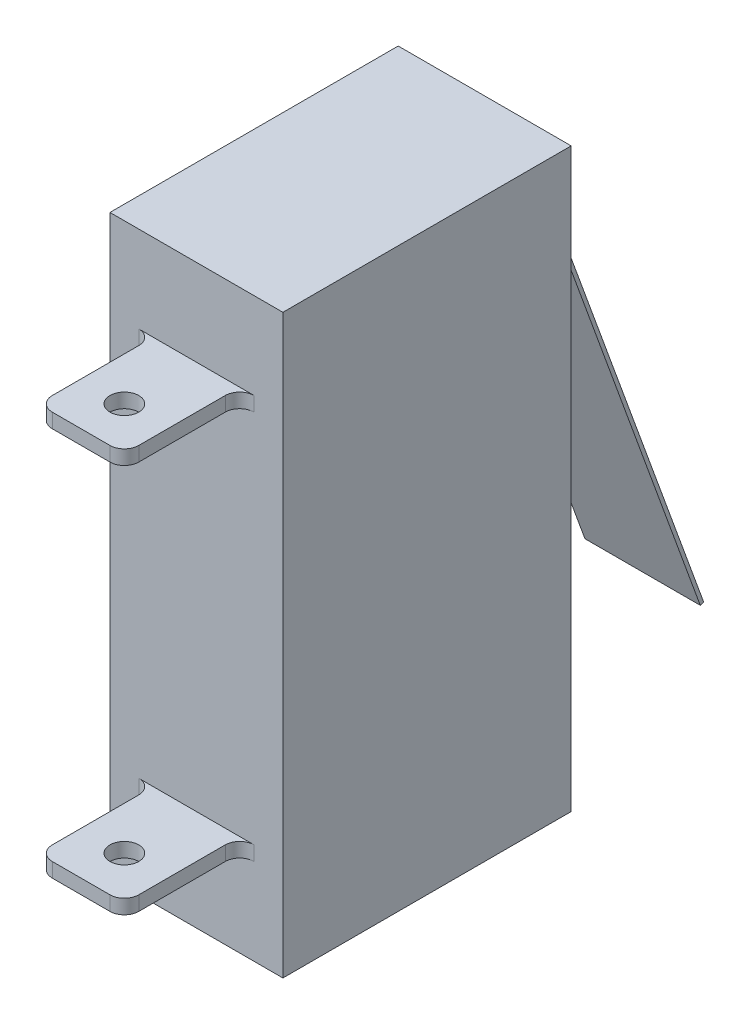
ISO-10303-21;
HEADER;
FILE_DESCRIPTION(('STEP AP214'),'2;1');
FILE_NAME('part.step','',(''),(''),'','','');
FILE_SCHEMA(('AUTOMOTIVE_DESIGN { 1 0 10303 214 1 1 1 1 }'));
ENDSEC;
DATA;
#1=APPLICATION_CONTEXT('core data for automotive mechanical design processes');
#2=APPLICATION_PROTOCOL_DEFINITION('international standard','automotive_design',2000,#1);
#3=PRODUCT_CONTEXT('',#1,'mechanical');
#4=PRODUCT('Part','Part','',(#3));
#5=PRODUCT_RELATED_PRODUCT_CATEGORY('part','',(#4));
#6=PRODUCT_DEFINITION_FORMATION('','',#4);
#7=PRODUCT_DEFINITION_CONTEXT('part definition',#1,'design');
#8=PRODUCT_DEFINITION('design','',#6,#7);
#9=PRODUCT_DEFINITION_SHAPE('','',#8);
#10=(LENGTH_UNIT() NAMED_UNIT(*) SI_UNIT(.MILLI.,.METRE.));
#11=(NAMED_UNIT(*) PLANE_ANGLE_UNIT() SI_UNIT($,.RADIAN.));
#12=(NAMED_UNIT(*) SI_UNIT($,.STERADIAN.) SOLID_ANGLE_UNIT());
#13=UNCERTAINTY_MEASURE_WITH_UNIT(LENGTH_MEASURE(1.E-05),#10,'distance_accuracy_value','');
#14=(GEOMETRIC_REPRESENTATION_CONTEXT(3) GLOBAL_UNCERTAINTY_ASSIGNED_CONTEXT((#13)) GLOBAL_UNIT_ASSIGNED_CONTEXT((#10,
#11,#12)) REPRESENTATION_CONTEXT('',''));
#15=CARTESIAN_POINT('',(0.,0.,0.));
#16=DIRECTION('',(0.,0.,1.));
#17=DIRECTION('',(1.,0.,0.));
#18=AXIS2_PLACEMENT_3D('',#15,#16,#17);
#19=CARTESIAN_POINT('',(6.,10.,-5.));
#20=DIRECTION('',(0.,0.,1.));
#21=DIRECTION('',(0.,-1.,0.));
#22=AXIS2_PLACEMENT_3D('',#19,#20,#21);
#23=PLANE('',#22);
#24=DIRECTION('',(0.,-1.,0.));
#25=VECTOR('',#24,1.);
#26=CARTESIAN_POINT('',(0.875,10.,-5.));
#27=LINE('',#26,#25);
#28=CARTESIAN_POINT('',(0.875,7.125,-5.));
#29=VERTEX_POINT('',#28);
#30=CARTESIAN_POINT('',(0.875,6.74473303781556,-5.));
#31=VERTEX_POINT('',#30);
#32=EDGE_CURVE('E458',#29,#31,#27,.T.);
#33=ORIENTED_EDGE('',*,*,#32,.T.);
#34=DIRECTION('',(-1.,0.,0.));
#35=VECTOR('',#34,1.);
#36=CARTESIAN_POINT('',(5.,6.74473303781556,-5.));
#37=LINE('',#36,#35);
#38=CARTESIAN_POINT('',(5.125,6.74473303781556,-5.));
#39=VERTEX_POINT('',#38);
#40=EDGE_CURVE('E461',#31,#39,#37,.F.);
#41=ORIENTED_EDGE('',*,*,#40,.T.);
#42=DIRECTION('',(0.,-1.,0.));
#43=VECTOR('',#42,1.);
#44=CARTESIAN_POINT('',(5.125,7.,-5.));
#45=LINE('',#44,#43);
#46=CARTESIAN_POINT('',(5.125,7.125,-5.));
#47=VERTEX_POINT('',#46);
#48=EDGE_CURVE('E456',#39,#47,#45,.F.);
#49=ORIENTED_EDGE('',*,*,#48,.T.);
#50=DIRECTION('',(1.,0.,0.));
#51=VECTOR('',#50,1.);
#52=CARTESIAN_POINT('',(1.,7.125,-5.));
#53=LINE('',#52,#51);
#54=EDGE_CURVE('E454',#47,#29,#53,.F.);
#55=ORIENTED_EDGE('',*,*,#54,.T.);
#56=EDGE_LOOP('',(#33,#41,#49,#55));
#57=FACE_BOUND('',#56,.T.);
#58=DIRECTION('',(0.,1.,0.));
#59=VECTOR('',#58,1.);
#60=CARTESIAN_POINT('',(0.,10.,-5.));
#61=LINE('',#60,#59);
#62=CARTESIAN_POINT('',(0.,-10.,-5.));
#63=VERTEX_POINT('',#62);
#64=CARTESIAN_POINT('',(0.,10.,-5.));
#65=VERTEX_POINT('',#64);
#66=EDGE_CURVE('E327',#63,#65,#61,.T.);
#67=ORIENTED_EDGE('',*,*,#66,.T.);
#68=DIRECTION('',(-1.,0.,0.));
#69=VECTOR('',#68,1.);
#70=CARTESIAN_POINT('',(6.,10.,-5.));
#71=LINE('',#70,#69);
#72=CARTESIAN_POINT('',(6.,10.,-5.));
#73=VERTEX_POINT('',#72);
#74=EDGE_CURVE('E354',#73,#65,#71,.T.);
#75=ORIENTED_EDGE('',*,*,#74,.F.);
#76=DIRECTION('',(0.,1.,0.));
#77=VECTOR('',#76,1.);
#78=CARTESIAN_POINT('',(6.,10.,-5.));
#79=LINE('',#78,#77);
#80=CARTESIAN_POINT('',(6.,-10.,-5.));
#81=VERTEX_POINT('',#80);
#82=EDGE_CURVE('E328',#81,#73,#79,.T.);
#83=ORIENTED_EDGE('',*,*,#82,.F.);
#84=DIRECTION('',(-1.,0.,0.));
#85=VECTOR('',#84,1.);
#86=CARTESIAN_POINT('',(6.,-10.,-5.));
#87=LINE('',#86,#85);
#88=EDGE_CURVE('E338',#81,#63,#87,.T.);
#89=ORIENTED_EDGE('',*,*,#88,.T.);
#90=EDGE_LOOP('',(#67,#75,#83,#89));
#91=FACE_BOUND('',#90,.T.);
#92=ADVANCED_FACE('F35',(#57,#91),#23,.F.);
#93=CARTESIAN_POINT('',(6.,10.,5.));
#94=DIRECTION('',(0.,0.,-1.));
#95=DIRECTION('',(0.,1.,0.));
#96=AXIS2_PLACEMENT_3D('',#93,#94,#95);
#97=PLANE('',#96);
#98=DIRECTION('',(1.,0.,0.));
#99=VECTOR('',#98,1.);
#100=CARTESIAN_POINT('',(1.5,6.5,5.));
#101=LINE('',#100,#99);
#102=CARTESIAN_POINT('',(1.,6.5,5.));
#103=VERTEX_POINT('',#102);
#104=CARTESIAN_POINT('',(5.,6.5,5.));
#105=VERTEX_POINT('',#104);
#106=EDGE_CURVE('E305',#103,#105,#101,.T.);
#107=ORIENTED_EDGE('',*,*,#106,.F.);
#108=DIRECTION('',(0.,-1.,0.));
#109=VECTOR('',#108,1.);
#110=CARTESIAN_POINT('',(1.,7.,5.));
#111=LINE('',#110,#109);
#112=CARTESIAN_POINT('',(1.,7.,5.));
#113=VERTEX_POINT('',#112);
#114=EDGE_CURVE('E365',#103,#113,#111,.F.);
#115=ORIENTED_EDGE('',*,*,#114,.T.);
#116=DIRECTION('',(-1.,0.,0.));
#117=VECTOR('',#116,1.);
#118=CARTESIAN_POINT('',(1.5,7.,5.));
#119=LINE('',#118,#117);
#120=CARTESIAN_POINT('',(5.,7.,5.));
#121=VERTEX_POINT('',#120);
#122=EDGE_CURVE('E310',#121,#113,#119,.T.);
#123=ORIENTED_EDGE('',*,*,#122,.F.);
#124=DIRECTION('',(0.,1.,0.));
#125=VECTOR('',#124,1.);
#126=CARTESIAN_POINT('',(5.,6.5,5.));
#127=LINE('',#126,#125);
#128=EDGE_CURVE('E362',#121,#105,#127,.F.);
#129=ORIENTED_EDGE('',*,*,#128,.T.);
#130=EDGE_LOOP('',(#107,#115,#123,#129));
#131=FACE_BOUND('',#130,.T.);
#132=DIRECTION('',(0.,-1.,0.));
#133=VECTOR('',#132,1.);
#134=CARTESIAN_POINT('',(0.,10.,5.));
#135=LINE('',#134,#133);
#136=CARTESIAN_POINT('',(0.,10.,5.));
#137=VERTEX_POINT('',#136);
#138=CARTESIAN_POINT('',(0.,-10.,5.));
#139=VERTEX_POINT('',#138);
#140=EDGE_CURVE('E343',#137,#139,#135,.T.);
#141=ORIENTED_EDGE('',*,*,#140,.T.);
#142=DIRECTION('',(-1.,0.,0.));
#143=VECTOR('',#142,1.);
#144=CARTESIAN_POINT('',(6.,-10.,5.));
#145=LINE('',#144,#143);
#146=CARTESIAN_POINT('',(6.,-10.,5.));
#147=VERTEX_POINT('',#146);
#148=EDGE_CURVE('E348',#147,#139,#145,.T.);
#149=ORIENTED_EDGE('',*,*,#148,.F.);
#150=DIRECTION('',(0.,-1.,0.));
#151=VECTOR('',#150,1.);
#152=CARTESIAN_POINT('',(6.,10.,5.));
#153=LINE('',#152,#151);
#154=CARTESIAN_POINT('',(6.,10.,5.));
#155=VERTEX_POINT('',#154);
#156=EDGE_CURVE('E334',#155,#147,#153,.T.);
#157=ORIENTED_EDGE('',*,*,#156,.F.);
#158=DIRECTION('',(-1.,0.,0.));
#159=VECTOR('',#158,1.);
#160=CARTESIAN_POINT('',(6.,10.,5.));
#161=LINE('',#160,#159);
#162=EDGE_CURVE('E351',#155,#137,#161,.T.);
#163=ORIENTED_EDGE('',*,*,#162,.T.);
#164=EDGE_LOOP('',(#141,#149,#157,#163));
#165=FACE_BOUND('',#164,.T.);
#166=DIRECTION('',(-1.,0.,0.));
#167=VECTOR('',#166,1.);
#168=CARTESIAN_POINT('',(1.5,-6.5,5.));
#169=LINE('',#168,#167);
#170=CARTESIAN_POINT('',(5.,-6.5,5.));
#171=VERTEX_POINT('',#170);
#172=CARTESIAN_POINT('',(1.,-6.5,5.));
#173=VERTEX_POINT('',#172);
#174=EDGE_CURVE('E288',#171,#173,#169,.T.);
#175=ORIENTED_EDGE('',*,*,#174,.F.);
#176=DIRECTION('',(0.,1.,0.));
#177=VECTOR('',#176,1.);
#178=CARTESIAN_POINT('',(5.,-7.,5.));
#179=LINE('',#178,#177);
#180=CARTESIAN_POINT('',(5.,-7.,5.));
#181=VERTEX_POINT('',#180);
#182=EDGE_CURVE('E371',#171,#181,#179,.F.);
#183=ORIENTED_EDGE('',*,*,#182,.T.);
#184=DIRECTION('',(1.,0.,0.));
#185=VECTOR('',#184,1.);
#186=CARTESIAN_POINT('',(1.5,-7.,5.));
#187=LINE('',#186,#185);
#188=CARTESIAN_POINT('',(1.,-7.,5.));
#189=VERTEX_POINT('',#188);
#190=EDGE_CURVE('E283',#189,#181,#187,.T.);
#191=ORIENTED_EDGE('',*,*,#190,.F.);
#192=DIRECTION('',(0.,-1.,0.));
#193=VECTOR('',#192,1.);
#194=CARTESIAN_POINT('',(1.,-6.5,5.));
#195=LINE('',#194,#193);
#196=EDGE_CURVE('E368',#189,#173,#195,.F.);
#197=ORIENTED_EDGE('',*,*,#196,.T.);
#198=EDGE_LOOP('',(#175,#183,#191,#197));
#199=FACE_BOUND('',#198,.T.);
#200=ADVANCED_FACE('F512',(#131,#165,#199),#97,.F.);
#201=CARTESIAN_POINT('',(6.,10.,5.));
#202=DIRECTION('',(0.,-1.,0.));
#203=DIRECTION('',(0.,0.,-1.));
#204=AXIS2_PLACEMENT_3D('',#201,#202,#203);
#205=PLANE('',#204);
#206=DIRECTION('',(0.,0.,1.));
#207=VECTOR('',#206,1.);
#208=CARTESIAN_POINT('',(0.,10.,5.));
#209=LINE('',#208,#207);
#210=EDGE_CURVE('E341',#65,#137,#209,.T.);
#211=ORIENTED_EDGE('',*,*,#210,.T.);
#212=ORIENTED_EDGE('',*,*,#162,.F.);
#213=DIRECTION('',(0.,0.,1.));
#214=VECTOR('',#213,1.);
#215=CARTESIAN_POINT('',(6.,10.,5.));
#216=LINE('',#215,#214);
#217=EDGE_CURVE('E331',#73,#155,#216,.T.);
#218=ORIENTED_EDGE('',*,*,#217,.F.);
#219=ORIENTED_EDGE('',*,*,#74,.T.);
#220=EDGE_LOOP('',(#211,#212,#218,#219));
#221=FACE_BOUND('',#220,.T.);
#222=ADVANCED_FACE('F524',(#221),#205,.F.);
#223=CARTESIAN_POINT('',(6.,-10.,5.));
#224=DIRECTION('',(0.,1.,0.));
#225=DIRECTION('',(0.,0.,1.));
#226=AXIS2_PLACEMENT_3D('',#223,#224,#225);
#227=PLANE('',#226);
#228=DIRECTION('',(0.,0.,-1.));
#229=VECTOR('',#228,1.);
#230=CARTESIAN_POINT('',(0.,-10.,5.));
#231=LINE('',#230,#229);
#232=EDGE_CURVE('E332',#139,#63,#231,.T.);
#233=ORIENTED_EDGE('',*,*,#232,.T.);
#234=ORIENTED_EDGE('',*,*,#88,.F.);
#235=DIRECTION('',(0.,0.,-1.));
#236=VECTOR('',#235,1.);
#237=CARTESIAN_POINT('',(6.,-10.,5.));
#238=LINE('',#237,#236);
#239=EDGE_CURVE('E336',#147,#81,#238,.T.);
#240=ORIENTED_EDGE('',*,*,#239,.F.);
#241=ORIENTED_EDGE('',*,*,#148,.T.);
#242=EDGE_LOOP('',(#233,#234,#240,#241));
#243=FACE_BOUND('',#242,.T.);
#244=ADVANCED_FACE('F531',(#243),#227,.F.);
#245=CARTESIAN_POINT('',(6.,0.,0.));
#246=DIRECTION('',(1.,0.,0.));
#247=DIRECTION('',(0.,0.,-1.));
#248=AXIS2_PLACEMENT_3D('',#245,#246,#247);
#249=PLANE('',#248);
#250=ORIENTED_EDGE('',*,*,#82,.T.);
#251=ORIENTED_EDGE('',*,*,#217,.T.);
#252=ORIENTED_EDGE('',*,*,#156,.T.);
#253=ORIENTED_EDGE('',*,*,#239,.T.);
#254=EDGE_LOOP('',(#250,#251,#252,#253));
#255=FACE_BOUND('',#254,.T.);
#256=ADVANCED_FACE('F527',(#255),#249,.T.);
#257=CARTESIAN_POINT('',(0.,0.,0.));
#258=DIRECTION('',(1.,0.,0.));
#259=DIRECTION('',(0.,0.,-1.));
#260=AXIS2_PLACEMENT_3D('',#257,#258,#259);
#261=PLANE('',#260);
#262=ORIENTED_EDGE('',*,*,#66,.F.);
#263=ORIENTED_EDGE('',*,*,#232,.F.);
#264=ORIENTED_EDGE('',*,*,#140,.F.);
#265=ORIENTED_EDGE('',*,*,#210,.F.);
#266=EDGE_LOOP('',(#262,#263,#264,#265));
#267=FACE_BOUND('',#266,.T.);
#268=ADVANCED_FACE('F520',(#267),#261,.F.);
#269=CARTESIAN_POINT('',(1.5,7.,9.));
#270=DIRECTION('',(1.,0.,0.));
#271=DIRECTION('',(0.,0.,-1.));
#272=AXIS2_PLACEMENT_3D('',#269,#270,#271);
#273=PLANE('',#272);
#274=DIRECTION('',(0.,0.,-1.));
#275=VECTOR('',#274,1.);
#276=CARTESIAN_POINT('',(1.5,7.,9.));
#277=LINE('',#276,#275);
#278=CARTESIAN_POINT('',(1.5,7.,8.5));
#279=VERTEX_POINT('',#278);
#280=CARTESIAN_POINT('',(1.5,7.,5.5));
#281=VERTEX_POINT('',#280);
#282=EDGE_CURVE('E313',#279,#281,#277,.T.);
#283=ORIENTED_EDGE('',*,*,#282,.T.);
#284=DIRECTION('',(0.,-1.,0.));
#285=VECTOR('',#284,1.);
#286=CARTESIAN_POINT('',(1.5,6.5,5.5));
#287=LINE('',#286,#285);
#288=CARTESIAN_POINT('',(1.5,6.5,5.5));
#289=VERTEX_POINT('',#288);
#290=EDGE_CURVE('E395',#281,#289,#287,.T.);
#291=ORIENTED_EDGE('',*,*,#290,.T.);
#292=DIRECTION('',(0.,0.,-1.));
#293=VECTOR('',#292,1.);
#294=CARTESIAN_POINT('',(1.5,6.5,9.));
#295=LINE('',#294,#293);
#296=CARTESIAN_POINT('',(1.5,6.5,8.5));
#297=VERTEX_POINT('',#296);
#298=EDGE_CURVE('E324',#297,#289,#295,.T.);
#299=ORIENTED_EDGE('',*,*,#298,.F.);
#300=DIRECTION('',(0.,-1.,0.));
#301=VECTOR('',#300,1.);
#302=CARTESIAN_POINT('',(1.5,7.,8.5));
#303=LINE('',#302,#301);
#304=EDGE_CURVE('E393',#297,#279,#303,.F.);
#305=ORIENTED_EDGE('',*,*,#304,.T.);
#306=EDGE_LOOP('',(#283,#291,#299,#305));
#307=FACE_BOUND('',#306,.T.);
#308=ADVANCED_FACE('F826',(#307),#273,.F.);
#309=CARTESIAN_POINT('',(1.5,6.5,9.));
#310=DIRECTION('',(0.,1.,0.));
#311=DIRECTION('',(0.,0.,1.));
#312=AXIS2_PLACEMENT_3D('',#309,#310,#311);
#313=PLANE('',#312);
#314=CARTESIAN_POINT('',(3.,6.5,7.5));
#315=DIRECTION('',(0.,1.,0.));
#316=DIRECTION('',(0.,0.,1.));
#317=AXIS2_PLACEMENT_3D('',#314,#315,#316);
#318=CIRCLE('',#317,0.5);
#319=CARTESIAN_POINT('',(3.,6.5,8.));
#320=VERTEX_POINT('',#319);
#321=EDGE_CURVE('E280',#320,#320,#318,.T.);
#322=ORIENTED_EDGE('',*,*,#321,.T.);
#323=EDGE_LOOP('',(#322));
#324=FACE_BOUND('',#323,.T.);
#325=DIRECTION('',(1.,0.,0.));
#326=VECTOR('',#325,1.);
#327=CARTESIAN_POINT('',(1.5,6.5,9.));
#328=LINE('',#327,#326);
#329=CARTESIAN_POINT('',(2.,6.5,9.));
#330=VERTEX_POINT('',#329);
#331=CARTESIAN_POINT('',(4.,6.5,9.));
#332=VERTEX_POINT('',#331);
#333=EDGE_CURVE('E306',#330,#332,#328,.T.);
#334=ORIENTED_EDGE('',*,*,#333,.F.);
#335=CARTESIAN_POINT('',(2.,6.5,8.5));
#336=DIRECTION('',(0.,1.,0.));
#337=DIRECTION('',(0.,0.,1.));
#338=AXIS2_PLACEMENT_3D('',#335,#336,#337);
#339=CIRCLE('',#338,0.5);
#340=EDGE_CURVE('E411',#330,#297,#339,.F.);
#341=ORIENTED_EDGE('',*,*,#340,.T.);
#342=ORIENTED_EDGE('',*,*,#298,.T.);
#343=CARTESIAN_POINT('',(1.,6.5,5.5));
#344=DIRECTION('',(0.,1.,0.));
#345=DIRECTION('',(0.,0.,1.));
#346=AXIS2_PLACEMENT_3D('',#343,#344,#345);
#347=CIRCLE('',#346,0.5);
#348=EDGE_CURVE('E427',#289,#103,#347,.T.);
#349=ORIENTED_EDGE('',*,*,#348,.T.);
#350=ORIENTED_EDGE('',*,*,#106,.T.);
#351=CARTESIAN_POINT('',(5.,6.5,5.5));
#352=DIRECTION('',(0.,1.,0.));
#353=DIRECTION('',(0.,0.,1.));
#354=AXIS2_PLACEMENT_3D('',#351,#352,#353);
#355=CIRCLE('',#354,0.5);
#356=CARTESIAN_POINT('',(4.5,6.5,5.5));
#357=VERTEX_POINT('',#356);
#358=EDGE_CURVE('E435',#105,#357,#355,.T.);
#359=ORIENTED_EDGE('',*,*,#358,.T.);
#360=DIRECTION('',(0.,0.,-1.));
#361=VECTOR('',#360,1.);
#362=CARTESIAN_POINT('',(4.5,6.5,9.));
#363=LINE('',#362,#361);
#364=CARTESIAN_POINT('',(4.5,6.5,8.5));
#365=VERTEX_POINT('',#364);
#366=EDGE_CURVE('E321',#365,#357,#363,.T.);
#367=ORIENTED_EDGE('',*,*,#366,.F.);
#368=CARTESIAN_POINT('',(4.,6.5,8.5));
#369=DIRECTION('',(0.,1.,0.));
#370=DIRECTION('',(0.,0.,1.));
#371=AXIS2_PLACEMENT_3D('',#368,#369,#370);
#372=CIRCLE('',#371,0.5);
#373=EDGE_CURVE('E409',#365,#332,#372,.F.);
#374=ORIENTED_EDGE('',*,*,#373,.T.);
#375=EDGE_LOOP('',(#334,#341,#342,#349,#350,#359,#367,#374));
#376=FACE_BOUND('',#375,.T.);
#377=ADVANCED_FACE('F832',(#324,#376),#313,.F.);
#378=CARTESIAN_POINT('',(4.5,7.,9.));
#379=DIRECTION('',(-1.,0.,0.));
#380=DIRECTION('',(0.,0.,1.));
#381=AXIS2_PLACEMENT_3D('',#378,#379,#380);
#382=PLANE('',#381);
#383=ORIENTED_EDGE('',*,*,#366,.T.);
#384=DIRECTION('',(0.,1.,0.));
#385=VECTOR('',#384,1.);
#386=CARTESIAN_POINT('',(4.5,7.,5.5));
#387=LINE('',#386,#385);
#388=CARTESIAN_POINT('',(4.5,7.,5.5));
#389=VERTEX_POINT('',#388);
#390=EDGE_CURVE('E400',#357,#389,#387,.T.);
#391=ORIENTED_EDGE('',*,*,#390,.T.);
#392=DIRECTION('',(0.,0.,-1.));
#393=VECTOR('',#392,1.);
#394=CARTESIAN_POINT('',(4.5,7.,9.));
#395=LINE('',#394,#393);
#396=CARTESIAN_POINT('',(4.5,7.,8.5));
#397=VERTEX_POINT('',#396);
#398=EDGE_CURVE('E318',#397,#389,#395,.T.);
#399=ORIENTED_EDGE('',*,*,#398,.F.);
#400=DIRECTION('',(0.,1.,0.));
#401=VECTOR('',#400,1.);
#402=CARTESIAN_POINT('',(4.5,6.5,8.5));
#403=LINE('',#402,#401);
#404=EDGE_CURVE('E398',#397,#365,#403,.F.);
#405=ORIENTED_EDGE('',*,*,#404,.T.);
#406=EDGE_LOOP('',(#383,#391,#399,#405));
#407=FACE_BOUND('',#406,.T.);
#408=ADVANCED_FACE('F839',(#407),#382,.F.);
#409=CARTESIAN_POINT('',(1.5,7.,9.));
#410=DIRECTION('',(0.,-1.,0.));
#411=DIRECTION('',(0.,0.,-1.));
#412=AXIS2_PLACEMENT_3D('',#409,#410,#411);
#413=PLANE('',#412);
#414=CARTESIAN_POINT('',(3.,7.,7.5));
#415=DIRECTION('',(0.,-1.,0.));
#416=DIRECTION('',(0.,0.,-1.));
#417=AXIS2_PLACEMENT_3D('',#414,#415,#416);
#418=CIRCLE('',#417,0.5);
#419=CARTESIAN_POINT('',(3.,7.,7.));
#420=VERTEX_POINT('',#419);
#421=EDGE_CURVE('E277',#420,#420,#418,.T.);
#422=ORIENTED_EDGE('',*,*,#421,.T.);
#423=EDGE_LOOP('',(#422));
#424=FACE_BOUND('',#423,.T.);
#425=ORIENTED_EDGE('',*,*,#282,.F.);
#426=CARTESIAN_POINT('',(2.,7.,8.5));
#427=DIRECTION('',(0.,-1.,0.));
#428=DIRECTION('',(0.,0.,-1.));
#429=AXIS2_PLACEMENT_3D('',#426,#427,#428);
#430=CIRCLE('',#429,0.5);
#431=CARTESIAN_POINT('',(2.,7.,9.));
#432=VERTEX_POINT('',#431);
#433=EDGE_CURVE('E415',#279,#432,#430,.F.);
#434=ORIENTED_EDGE('',*,*,#433,.T.);
#435=DIRECTION('',(-1.,0.,0.));
#436=VECTOR('',#435,1.);
#437=CARTESIAN_POINT('',(1.5,7.,9.));
#438=LINE('',#437,#436);
#439=CARTESIAN_POINT('',(4.,7.,9.));
#440=VERTEX_POINT('',#439);
#441=EDGE_CURVE('E309',#440,#432,#438,.T.);
#442=ORIENTED_EDGE('',*,*,#441,.F.);
#443=CARTESIAN_POINT('',(4.,7.,8.5));
#444=DIRECTION('',(0.,-1.,0.));
#445=DIRECTION('',(0.,0.,-1.));
#446=AXIS2_PLACEMENT_3D('',#443,#444,#445);
#447=CIRCLE('',#446,0.5);
#448=EDGE_CURVE('E413',#440,#397,#447,.F.);
#449=ORIENTED_EDGE('',*,*,#448,.T.);
#450=ORIENTED_EDGE('',*,*,#398,.T.);
#451=CARTESIAN_POINT('',(5.,7.,5.5));
#452=DIRECTION('',(0.,-1.,0.));
#453=DIRECTION('',(0.,0.,-1.));
#454=AXIS2_PLACEMENT_3D('',#451,#452,#453);
#455=CIRCLE('',#454,0.5);
#456=EDGE_CURVE('E432',#389,#121,#455,.T.);
#457=ORIENTED_EDGE('',*,*,#456,.T.);
#458=ORIENTED_EDGE('',*,*,#122,.T.);
#459=CARTESIAN_POINT('',(1.,7.,5.5));
#460=DIRECTION('',(0.,-1.,0.));
#461=DIRECTION('',(0.,0.,-1.));
#462=AXIS2_PLACEMENT_3D('',#459,#460,#461);
#463=CIRCLE('',#462,0.5);
#464=EDGE_CURVE('E430',#113,#281,#463,.T.);
#465=ORIENTED_EDGE('',*,*,#464,.T.);
#466=EDGE_LOOP('',(#425,#434,#442,#449,#450,#457,#458,#465));
#467=FACE_BOUND('',#466,.T.);
#468=ADVANCED_FACE('F846',(#424,#467),#413,.F.);
#469=CARTESIAN_POINT('',(0.,0.,9.));
#470=DIRECTION('',(0.,0.,1.));
#471=DIRECTION('',(1.,0.,0.));
#472=AXIS2_PLACEMENT_3D('',#469,#470,#471);
#473=PLANE('',#472);
#474=ORIENTED_EDGE('',*,*,#441,.T.);
#475=DIRECTION('',(0.,-1.,0.));
#476=VECTOR('',#475,1.);
#477=CARTESIAN_POINT('',(2.,6.5,9.));
#478=LINE('',#477,#476);
#479=EDGE_CURVE('E406',#432,#330,#478,.T.);
#480=ORIENTED_EDGE('',*,*,#479,.T.);
#481=ORIENTED_EDGE('',*,*,#333,.T.);
#482=DIRECTION('',(0.,1.,0.));
#483=VECTOR('',#482,1.);
#484=CARTESIAN_POINT('',(4.,7.,9.));
#485=LINE('',#484,#483);
#486=EDGE_CURVE('E403',#332,#440,#485,.T.);
#487=ORIENTED_EDGE('',*,*,#486,.T.);
#488=EDGE_LOOP('',(#474,#480,#481,#487));
#489=FACE_BOUND('',#488,.T.);
#490=ADVANCED_FACE('F854',(#489),#473,.T.);
#491=CARTESIAN_POINT('',(1.5,-6.5,9.));
#492=DIRECTION('',(1.,0.,0.));
#493=DIRECTION('',(0.,0.,-1.));
#494=AXIS2_PLACEMENT_3D('',#491,#492,#493);
#495=PLANE('',#494);
#496=DIRECTION('',(0.,0.,-1.));
#497=VECTOR('',#496,1.);
#498=CARTESIAN_POINT('',(1.5,-6.5,9.));
#499=LINE('',#498,#497);
#500=CARTESIAN_POINT('',(1.5,-6.5,8.5));
#501=VERTEX_POINT('',#500);
#502=CARTESIAN_POINT('',(1.5,-6.5,5.5));
#503=VERTEX_POINT('',#502);
#504=EDGE_CURVE('E291',#501,#503,#499,.T.);
#505=ORIENTED_EDGE('',*,*,#504,.T.);
#506=DIRECTION('',(0.,-1.,0.));
#507=VECTOR('',#506,1.);
#508=CARTESIAN_POINT('',(1.5,-7.,5.5));
#509=LINE('',#508,#507);
#510=CARTESIAN_POINT('',(1.5,-7.,5.5));
#511=VERTEX_POINT('',#510);
#512=EDGE_CURVE('E376',#503,#511,#509,.T.);
#513=ORIENTED_EDGE('',*,*,#512,.T.);
#514=DIRECTION('',(0.,0.,-1.));
#515=VECTOR('',#514,1.);
#516=CARTESIAN_POINT('',(1.5,-7.,9.));
#517=LINE('',#516,#515);
#518=CARTESIAN_POINT('',(1.5,-7.,8.5));
#519=VERTEX_POINT('',#518);
#520=EDGE_CURVE('E302',#519,#511,#517,.T.);
#521=ORIENTED_EDGE('',*,*,#520,.F.);
#522=DIRECTION('',(0.,-1.,0.));
#523=VECTOR('',#522,1.);
#524=CARTESIAN_POINT('',(1.5,-6.5,8.5));
#525=LINE('',#524,#523);
#526=EDGE_CURVE('E374',#519,#501,#525,.F.);
#527=ORIENTED_EDGE('',*,*,#526,.T.);
#528=EDGE_LOOP('',(#505,#513,#521,#527));
#529=FACE_BOUND('',#528,.T.);
#530=ADVANCED_FACE('F569',(#529),#495,.F.);
#531=CARTESIAN_POINT('',(1.5,-7.,9.));
#532=DIRECTION('',(0.,1.,0.));
#533=DIRECTION('',(0.,0.,1.));
#534=AXIS2_PLACEMENT_3D('',#531,#532,#533);
#535=PLANE('',#534);
#536=CARTESIAN_POINT('',(3.,-7.,7.5));
#537=DIRECTION('',(0.,1.,0.));
#538=DIRECTION('',(0.,0.,1.));
#539=AXIS2_PLACEMENT_3D('',#536,#537,#538);
#540=CIRCLE('',#539,0.5);
#541=CARTESIAN_POINT('',(3.,-7.,8.));
#542=VERTEX_POINT('',#541);
#543=EDGE_CURVE('E274',#542,#542,#540,.T.);
#544=ORIENTED_EDGE('',*,*,#543,.T.);
#545=EDGE_LOOP('',(#544));
#546=FACE_BOUND('',#545,.T.);
#547=DIRECTION('',(1.,0.,0.));
#548=VECTOR('',#547,1.);
#549=CARTESIAN_POINT('',(1.5,-7.,9.));
#550=LINE('',#549,#548);
#551=CARTESIAN_POINT('',(2.,-7.,9.));
#552=VERTEX_POINT('',#551);
#553=CARTESIAN_POINT('',(4.,-7.,9.));
#554=VERTEX_POINT('',#553);
#555=EDGE_CURVE('E284',#552,#554,#550,.T.);
#556=ORIENTED_EDGE('',*,*,#555,.F.);
#557=CARTESIAN_POINT('',(2.,-7.,8.5));
#558=DIRECTION('',(0.,1.,0.));
#559=DIRECTION('',(0.,0.,1.));
#560=AXIS2_PLACEMENT_3D('',#557,#558,#559);
#561=CIRCLE('',#560,0.5);
#562=EDGE_CURVE('E387',#552,#519,#561,.F.);
#563=ORIENTED_EDGE('',*,*,#562,.T.);
#564=ORIENTED_EDGE('',*,*,#520,.T.);
#565=CARTESIAN_POINT('',(1.,-7.,5.5));
#566=DIRECTION('',(0.,1.,0.));
#567=DIRECTION('',(0.,0.,1.));
#568=AXIS2_PLACEMENT_3D('',#565,#566,#567);
#569=CIRCLE('',#568,0.5);
#570=EDGE_CURVE('E422',#511,#189,#569,.T.);
#571=ORIENTED_EDGE('',*,*,#570,.T.);
#572=ORIENTED_EDGE('',*,*,#190,.T.);
#573=CARTESIAN_POINT('',(5.,-7.,5.5));
#574=DIRECTION('',(0.,1.,0.));
#575=DIRECTION('',(0.,0.,1.));
#576=AXIS2_PLACEMENT_3D('',#573,#574,#575);
#577=CIRCLE('',#576,0.5);
#578=CARTESIAN_POINT('',(4.5,-7.,5.5));
#579=VERTEX_POINT('',#578);
#580=EDGE_CURVE('E420',#181,#579,#577,.T.);
#581=ORIENTED_EDGE('',*,*,#580,.T.);
#582=DIRECTION('',(0.,0.,-1.));
#583=VECTOR('',#582,1.);
#584=CARTESIAN_POINT('',(4.5,-7.,9.));
#585=LINE('',#584,#583);
#586=CARTESIAN_POINT('',(4.5,-7.,8.5));
#587=VERTEX_POINT('',#586);
#588=EDGE_CURVE('E299',#587,#579,#585,.T.);
#589=ORIENTED_EDGE('',*,*,#588,.F.);
#590=CARTESIAN_POINT('',(4.,-7.,8.5));
#591=DIRECTION('',(0.,1.,0.));
#592=DIRECTION('',(0.,0.,1.));
#593=AXIS2_PLACEMENT_3D('',#590,#591,#592);
#594=CIRCLE('',#593,0.5);
#595=EDGE_CURVE('E385',#587,#554,#594,.F.);
#596=ORIENTED_EDGE('',*,*,#595,.T.);
#597=EDGE_LOOP('',(#556,#563,#564,#571,#572,#581,#589,#596));
#598=FACE_BOUND('',#597,.T.);
#599=ADVANCED_FACE('F551',(#546,#598),#535,.F.);
#600=CARTESIAN_POINT('',(4.5,-6.5,9.));
#601=DIRECTION('',(-1.,0.,0.));
#602=DIRECTION('',(0.,0.,1.));
#603=AXIS2_PLACEMENT_3D('',#600,#601,#602);
#604=PLANE('',#603);
#605=ORIENTED_EDGE('',*,*,#588,.T.);
#606=DIRECTION('',(0.,1.,0.));
#607=VECTOR('',#606,1.);
#608=CARTESIAN_POINT('',(4.5,-6.5,5.5));
#609=LINE('',#608,#607);
#610=CARTESIAN_POINT('',(4.5,-6.5,5.5));
#611=VERTEX_POINT('',#610);
#612=EDGE_CURVE('E359',#579,#611,#609,.T.);
#613=ORIENTED_EDGE('',*,*,#612,.T.);
#614=DIRECTION('',(0.,0.,-1.));
#615=VECTOR('',#614,1.);
#616=CARTESIAN_POINT('',(4.5,-6.5,9.));
#617=LINE('',#616,#615);
#618=CARTESIAN_POINT('',(4.5,-6.5,8.5));
#619=VERTEX_POINT('',#618);
#620=EDGE_CURVE('E296',#619,#611,#617,.T.);
#621=ORIENTED_EDGE('',*,*,#620,.F.);
#622=DIRECTION('',(0.,1.,0.));
#623=VECTOR('',#622,1.);
#624=CARTESIAN_POINT('',(4.5,-7.,8.5));
#625=LINE('',#624,#623);
#626=EDGE_CURVE('E357',#619,#587,#625,.F.);
#627=ORIENTED_EDGE('',*,*,#626,.T.);
#628=EDGE_LOOP('',(#605,#613,#621,#627));
#629=FACE_BOUND('',#628,.T.);
#630=ADVANCED_FACE('F554',(#629),#604,.F.);
#631=CARTESIAN_POINT('',(1.5,-6.5,9.));
#632=DIRECTION('',(0.,-1.,0.));
#633=DIRECTION('',(0.,0.,-1.));
#634=AXIS2_PLACEMENT_3D('',#631,#632,#633);
#635=PLANE('',#634);
#636=CARTESIAN_POINT('',(3.,-6.5,7.5));
#637=DIRECTION('',(0.,-1.,0.));
#638=DIRECTION('',(0.,0.,-1.));
#639=AXIS2_PLACEMENT_3D('',#636,#637,#638);
#640=CIRCLE('',#639,0.5);
#641=CARTESIAN_POINT('',(3.,-6.5,7.));
#642=VERTEX_POINT('',#641);
#643=EDGE_CURVE('E253',#642,#642,#640,.T.);
#644=ORIENTED_EDGE('',*,*,#643,.T.);
#645=EDGE_LOOP('',(#644));
#646=FACE_BOUND('',#645,.T.);
#647=ORIENTED_EDGE('',*,*,#504,.F.);
#648=CARTESIAN_POINT('',(2.,-6.5,8.5));
#649=DIRECTION('',(0.,-1.,0.));
#650=DIRECTION('',(0.,0.,-1.));
#651=AXIS2_PLACEMENT_3D('',#648,#649,#650);
#652=CIRCLE('',#651,0.5);
#653=CARTESIAN_POINT('',(2.,-6.5,9.));
#654=VERTEX_POINT('',#653);
#655=EDGE_CURVE('E391',#501,#654,#652,.F.);
#656=ORIENTED_EDGE('',*,*,#655,.T.);
#657=DIRECTION('',(-1.,0.,0.));
#658=VECTOR('',#657,1.);
#659=CARTESIAN_POINT('',(1.5,-6.5,9.));
#660=LINE('',#659,#658);
#661=CARTESIAN_POINT('',(4.,-6.5,9.));
#662=VERTEX_POINT('',#661);
#663=EDGE_CURVE('E287',#662,#654,#660,.T.);
#664=ORIENTED_EDGE('',*,*,#663,.F.);
#665=CARTESIAN_POINT('',(4.,-6.5,8.5));
#666=DIRECTION('',(0.,-1.,0.));
#667=DIRECTION('',(0.,0.,-1.));
#668=AXIS2_PLACEMENT_3D('',#665,#666,#667);
#669=CIRCLE('',#668,0.5);
#670=EDGE_CURVE('E389',#662,#619,#669,.F.);
#671=ORIENTED_EDGE('',*,*,#670,.T.);
#672=ORIENTED_EDGE('',*,*,#620,.T.);
#673=CARTESIAN_POINT('',(5.,-6.5,5.5));
#674=DIRECTION('',(0.,-1.,0.));
#675=DIRECTION('',(0.,0.,-1.));
#676=AXIS2_PLACEMENT_3D('',#673,#674,#675);
#677=CIRCLE('',#676,0.5);
#678=EDGE_CURVE('E417',#611,#171,#677,.T.);
#679=ORIENTED_EDGE('',*,*,#678,.T.);
#680=ORIENTED_EDGE('',*,*,#174,.T.);
#681=CARTESIAN_POINT('',(1.,-6.5,5.5));
#682=DIRECTION('',(0.,-1.,0.));
#683=DIRECTION('',(0.,0.,-1.));
#684=AXIS2_PLACEMENT_3D('',#681,#682,#683);
#685=CIRCLE('',#684,0.5);
#686=EDGE_CURVE('E425',#173,#503,#685,.T.);
#687=ORIENTED_EDGE('',*,*,#686,.T.);
#688=EDGE_LOOP('',(#647,#656,#664,#671,#672,#679,#680,#687));
#689=FACE_BOUND('',#688,.T.);
#690=ADVANCED_FACE('F543',(#646,#689),#635,.F.);
#691=CARTESIAN_POINT('',(0.,0.,9.));
#692=DIRECTION('',(0.,0.,1.));
#693=DIRECTION('',(1.,0.,0.));
#694=AXIS2_PLACEMENT_3D('',#691,#692,#693);
#695=PLANE('',#694);
#696=ORIENTED_EDGE('',*,*,#663,.T.);
#697=DIRECTION('',(0.,-1.,0.));
#698=VECTOR('',#697,1.);
#699=CARTESIAN_POINT('',(2.,-7.,9.));
#700=LINE('',#699,#698);
#701=EDGE_CURVE('E382',#654,#552,#700,.T.);
#702=ORIENTED_EDGE('',*,*,#701,.T.);
#703=ORIENTED_EDGE('',*,*,#555,.T.);
#704=DIRECTION('',(0.,1.,0.));
#705=VECTOR('',#704,1.);
#706=CARTESIAN_POINT('',(4.,-6.5,9.));
#707=LINE('',#706,#705);
#708=EDGE_CURVE('E379',#554,#662,#707,.T.);
#709=ORIENTED_EDGE('',*,*,#708,.T.);
#710=EDGE_LOOP('',(#696,#702,#703,#709));
#711=FACE_BOUND('',#710,.T.);
#712=ADVANCED_FACE('F560',(#711),#695,.T.);
#713=CARTESIAN_POINT('',(5.,-6.5,5.5));
#714=DIRECTION('',(0.,-1.,0.));
#715=DIRECTION('',(0.,0.,-1.));
#716=AXIS2_PLACEMENT_3D('',#713,#714,#715);
#717=CYLINDRICAL_SURFACE('',#716,0.5);
#718=ORIENTED_EDGE('',*,*,#580,.F.);
#719=ORIENTED_EDGE('',*,*,#182,.F.);
#720=ORIENTED_EDGE('',*,*,#678,.F.);
#721=ORIENTED_EDGE('',*,*,#612,.F.);
#722=EDGE_LOOP('',(#718,#719,#720,#721));
#723=FACE_BOUND('',#722,.T.);
#724=ADVANCED_FACE('F547',(#723),#717,.F.);
#725=CARTESIAN_POINT('',(1.,-6.5,5.5));
#726=DIRECTION('',(0.,1.,0.));
#727=DIRECTION('',(0.,0.,1.));
#728=AXIS2_PLACEMENT_3D('',#725,#726,#727);
#729=CYLINDRICAL_SURFACE('',#728,0.5);
#730=ORIENTED_EDGE('',*,*,#686,.F.);
#731=ORIENTED_EDGE('',*,*,#196,.F.);
#732=ORIENTED_EDGE('',*,*,#570,.F.);
#733=ORIENTED_EDGE('',*,*,#512,.F.);
#734=EDGE_LOOP('',(#730,#731,#732,#733));
#735=FACE_BOUND('',#734,.T.);
#736=ADVANCED_FACE('F572',(#735),#729,.F.);
#737=CARTESIAN_POINT('',(2.,0.,8.5));
#738=DIRECTION('',(0.,1.,0.));
#739=DIRECTION('',(0.,0.,1.));
#740=AXIS2_PLACEMENT_3D('',#737,#738,#739);
#741=CYLINDRICAL_SURFACE('',#740,0.5);
#742=ORIENTED_EDGE('',*,*,#655,.F.);
#743=ORIENTED_EDGE('',*,*,#526,.F.);
#744=ORIENTED_EDGE('',*,*,#562,.F.);
#745=ORIENTED_EDGE('',*,*,#701,.F.);
#746=EDGE_LOOP('',(#742,#743,#744,#745));
#747=FACE_BOUND('',#746,.T.);
#748=ADVANCED_FACE('F565',(#747),#741,.T.);
#749=CARTESIAN_POINT('',(4.,0.,8.5));
#750=DIRECTION('',(0.,-1.,0.));
#751=DIRECTION('',(0.,0.,-1.));
#752=AXIS2_PLACEMENT_3D('',#749,#750,#751);
#753=CYLINDRICAL_SURFACE('',#752,0.5);
#754=ORIENTED_EDGE('',*,*,#595,.F.);
#755=ORIENTED_EDGE('',*,*,#626,.F.);
#756=ORIENTED_EDGE('',*,*,#670,.F.);
#757=ORIENTED_EDGE('',*,*,#708,.F.);
#758=EDGE_LOOP('',(#754,#755,#756,#757));
#759=FACE_BOUND('',#758,.T.);
#760=ADVANCED_FACE('F557',(#759),#753,.T.);
#761=CARTESIAN_POINT('',(1.,7.,5.5));
#762=DIRECTION('',(0.,1.,0.));
#763=DIRECTION('',(0.,0.,1.));
#764=AXIS2_PLACEMENT_3D('',#761,#762,#763);
#765=CYLINDRICAL_SURFACE('',#764,0.5);
#766=ORIENTED_EDGE('',*,*,#464,.F.);
#767=ORIENTED_EDGE('',*,*,#114,.F.);
#768=ORIENTED_EDGE('',*,*,#348,.F.);
#769=ORIENTED_EDGE('',*,*,#290,.F.);
#770=EDGE_LOOP('',(#766,#767,#768,#769));
#771=FACE_BOUND('',#770,.T.);
#772=ADVANCED_FACE('F584',(#771),#765,.F.);
#773=CARTESIAN_POINT('',(5.,7.,5.5));
#774=DIRECTION('',(0.,-1.,0.));
#775=DIRECTION('',(0.,0.,-1.));
#776=AXIS2_PLACEMENT_3D('',#773,#774,#775);
#777=CYLINDRICAL_SURFACE('',#776,0.5);
#778=ORIENTED_EDGE('',*,*,#358,.F.);
#779=ORIENTED_EDGE('',*,*,#128,.F.);
#780=ORIENTED_EDGE('',*,*,#456,.F.);
#781=ORIENTED_EDGE('',*,*,#390,.F.);
#782=EDGE_LOOP('',(#778,#779,#780,#781));
#783=FACE_BOUND('',#782,.T.);
#784=ADVANCED_FACE('F587',(#783),#777,.F.);
#785=CARTESIAN_POINT('',(2.,0.,8.5));
#786=DIRECTION('',(0.,1.,0.));
#787=DIRECTION('',(0.,0.,1.));
#788=AXIS2_PLACEMENT_3D('',#785,#786,#787);
#789=CYLINDRICAL_SURFACE('',#788,0.5);
#790=ORIENTED_EDGE('',*,*,#433,.F.);
#791=ORIENTED_EDGE('',*,*,#304,.F.);
#792=ORIENTED_EDGE('',*,*,#340,.F.);
#793=ORIENTED_EDGE('',*,*,#479,.F.);
#794=EDGE_LOOP('',(#790,#791,#792,#793));
#795=FACE_BOUND('',#794,.T.);
#796=ADVANCED_FACE('F591',(#795),#789,.T.);
#797=CARTESIAN_POINT('',(4.,0.,8.5));
#798=DIRECTION('',(0.,-1.,0.));
#799=DIRECTION('',(0.,0.,-1.));
#800=AXIS2_PLACEMENT_3D('',#797,#798,#799);
#801=CYLINDRICAL_SURFACE('',#800,0.5);
#802=ORIENTED_EDGE('',*,*,#373,.F.);
#803=ORIENTED_EDGE('',*,*,#404,.F.);
#804=ORIENTED_EDGE('',*,*,#448,.F.);
#805=ORIENTED_EDGE('',*,*,#486,.F.);
#806=EDGE_LOOP('',(#802,#803,#804,#805));
#807=FACE_BOUND('',#806,.T.);
#808=ADVANCED_FACE('F595',(#807),#801,.T.);
#809=CARTESIAN_POINT('',(3.,-10.,7.5));
#810=DIRECTION('',(0.,1.,0.));
#811=DIRECTION('',(0.,0.,1.));
#812=AXIS2_PLACEMENT_3D('',#809,#810,#811);
#813=CYLINDRICAL_SURFACE('',#812,0.5);
#814=ORIENTED_EDGE('',*,*,#643,.F.);
#815=EDGE_LOOP('',(#814));
#816=FACE_BOUND('',#815,.T.);
#817=ORIENTED_EDGE('',*,*,#543,.F.);
#818=EDGE_LOOP('',(#817));
#819=FACE_BOUND('',#818,.T.);
#820=ADVANCED_FACE('F599',(#816,#819),#813,.F.);
#821=ORIENTED_EDGE('',*,*,#421,.F.);
#822=EDGE_LOOP('',(#821));
#823=FACE_BOUND('',#822,.T.);
#824=ORIENTED_EDGE('',*,*,#321,.F.);
#825=EDGE_LOOP('',(#824));
#826=FACE_BOUND('',#825,.T.);
#827=ADVANCED_FACE('F660',(#823,#826),#813,.F.);
#828=CARTESIAN_POINT('',(5.,7.,-5.));
#829=DIRECTION('',(0.,-1.,0.));
#830=DIRECTION('',(0.,0.,-1.));
#831=AXIS2_PLACEMENT_3D('',#828,#829,#830);
#832=PLANE('',#831);
#833=DIRECTION('',(0.,0.,1.));
#834=VECTOR('',#833,1.);
#835=CARTESIAN_POINT('',(1.,7.,-5.));
#836=LINE('',#835,#834);
#837=CARTESIAN_POINT('',(1.,7.,-5.14989623089515));
#838=VERTEX_POINT('',#837);
#839=CARTESIAN_POINT('',(1.,7.,-5.125));
#840=VERTEX_POINT('',#839);
#841=EDGE_CURVE('E270',#838,#840,#836,.T.);
#842=ORIENTED_EDGE('',*,*,#841,.T.);
#843=DIRECTION('',(1.,0.,0.));
#844=VECTOR('',#843,1.);
#845=CARTESIAN_POINT('',(5.,7.,-5.125));
#846=LINE('',#845,#844);
#847=CARTESIAN_POINT('',(5.,7.,-5.125));
#848=VERTEX_POINT('',#847);
#849=EDGE_CURVE('E467',#840,#848,#846,.T.);
#850=ORIENTED_EDGE('',*,*,#849,.T.);
#851=DIRECTION('',(0.,0.,1.));
#852=VECTOR('',#851,1.);
#853=CARTESIAN_POINT('',(5.,7.,-5.));
#854=LINE('',#853,#852);
#855=CARTESIAN_POINT('',(5.,7.,-5.14989623089515));
#856=VERTEX_POINT('',#855);
#857=EDGE_CURVE('E244',#856,#848,#854,.T.);
#858=ORIENTED_EDGE('',*,*,#857,.F.);
#859=DIRECTION('',(-1.,0.,0.));
#860=VECTOR('',#859,1.);
#861=CARTESIAN_POINT('',(5.,7.,-5.14989623089515));
#862=LINE('',#861,#860);
#863=EDGE_CURVE('E441',#856,#838,#862,.T.);
#864=ORIENTED_EDGE('',*,*,#863,.T.);
#865=EDGE_LOOP('',(#842,#850,#858,#864));
#866=FACE_BOUND('',#865,.T.);
#867=ADVANCED_FACE('F505',(#866),#832,.F.);
#868=CARTESIAN_POINT('',(5.,0.,0.));
#869=DIRECTION('',(-1.,0.,0.));
#870=DIRECTION('',(0.,0.,1.));
#871=AXIS2_PLACEMENT_3D('',#868,#869,#870);
#872=PLANE('',#871);
#873=ORIENTED_EDGE('',*,*,#857,.T.);
#874=DIRECTION('',(0.,-1.,0.));
#875=VECTOR('',#874,1.);
#876=CARTESIAN_POINT('',(5.,6.875,-5.125));
#877=LINE('',#876,#875);
#878=CARTESIAN_POINT('',(5.,6.86973303781556,-5.125));
#879=VERTEX_POINT('',#878);
#880=EDGE_CURVE('E51',#848,#879,#877,.T.);
#881=ORIENTED_EDGE('',*,*,#880,.T.);
#882=CARTESIAN_POINT('',(5.,6.74473303781556,-5.125));
#883=DIRECTION('',(-1.,0.,0.));
#884=DIRECTION('',(0.,0.,1.));
#885=AXIS2_PLACEMENT_3D('',#882,#883,#884);
#886=CIRCLE('',#885,0.125);
#887=CARTESIAN_POINT('',(5.,6.86797738375408,-5.14587657046036));
#888=VERTEX_POINT('',#887);
#889=EDGE_CURVE('E11',#879,#888,#886,.T.);
#890=ORIENTED_EDGE('',*,*,#889,.T.);
#891=CARTESIAN_POINT('',(5.,6.375,-5.06237028861893));
#892=DIRECTION('',(-1.,0.,0.));
#893=DIRECTION('',(0.,0.,1.));
#894=AXIS2_PLACEMENT_3D('',#891,#892,#893);
#895=CIRCLE('',#894,0.5);
#896=CARTESIAN_POINT('',(5.,6.54601007166283,-5.53221659901189));
#897=VERTEX_POINT('',#896);
#898=EDGE_CURVE('E240',#888,#897,#895,.T.);
#899=ORIENTED_EDGE('',*,*,#898,.T.);
#900=DIRECTION('',(0.,-0.939692620785909,-0.342020143325666));
#901=VECTOR('',#900,1.);
#902=CARTESIAN_POINT('',(5.,6.875,-5.41247405772379));
#903=LINE('',#902,#901);
#904=CARTESIAN_POINT('',(5.,-7.04275251791571,-10.4781217021285));
#905=VERTEX_POINT('',#904);
#906=EDGE_CURVE('E232',#897,#905,#903,.T.);
#907=ORIENTED_EDGE('',*,*,#906,.T.);
#908=DIRECTION('',(0.,0.342020143325679,-0.939692620785904));
#909=VECTOR('',#908,1.);
#910=CARTESIAN_POINT('',(5.,-7.04275251791571,-10.4781217021285));
#911=LINE('',#910,#909);
#912=CARTESIAN_POINT('',(5.,-7.,-10.5955832797268));
#913=VERTEX_POINT('',#912);
#914=EDGE_CURVE('E237',#905,#913,#911,.T.);
#915=ORIENTED_EDGE('',*,*,#914,.T.);
#916=DIRECTION('',(0.,0.939692620785909,0.342020143325666));
#917=VECTOR('',#916,1.);
#918=CARTESIAN_POINT('',(5.,7.,-5.5));
#919=LINE('',#918,#917);
#920=CARTESIAN_POINT('',(5.,6.67101007166283,-5.6197425412881));
#921=VERTEX_POINT('',#920);
#922=EDGE_CURVE('E259',#913,#921,#919,.T.);
#923=ORIENTED_EDGE('',*,*,#922,.T.);
#924=CARTESIAN_POINT('',(5.,6.5,-5.14989623089514));
#925=DIRECTION('',(-1.,0.,0.));
#926=DIRECTION('',(0.,0.,1.));
#927=AXIS2_PLACEMENT_3D('',#924,#925,#926);
#928=CIRCLE('',#927,0.5);
#929=EDGE_CURVE('E448',#921,#856,#928,.F.);
#930=ORIENTED_EDGE('',*,*,#929,.T.);
#931=EDGE_LOOP('',(#873,#881,#890,#899,#907,#915,#923,#930));
#932=FACE_BOUND('',#931,.T.);
#933=ADVANCED_FACE('F234',(#932),#872,.F.);
#934=CARTESIAN_POINT('',(1.,0.,0.));
#935=DIRECTION('',(-1.,0.,0.));
#936=DIRECTION('',(0.,0.,1.));
#937=AXIS2_PLACEMENT_3D('',#934,#935,#936);
#938=PLANE('',#937);
#939=CARTESIAN_POINT('',(1.,6.375,-5.06237028861893));
#940=DIRECTION('',(-1.,0.,0.));
#941=DIRECTION('',(0.,0.,1.));
#942=AXIS2_PLACEMENT_3D('',#939,#940,#941);
#943=CIRCLE('',#942,0.5);
#944=CARTESIAN_POINT('',(1.,6.54601007166283,-5.53221659901189));
#945=VERTEX_POINT('',#944);
#946=CARTESIAN_POINT('',(1.,6.86797738375408,-5.14587657046036));
#947=VERTEX_POINT('',#946);
#948=EDGE_CURVE('E450',#945,#947,#943,.F.);
#949=ORIENTED_EDGE('',*,*,#948,.T.);
#950=CARTESIAN_POINT('',(1.,6.74473303781556,-5.125));
#951=DIRECTION('',(-1.,0.,0.));
#952=DIRECTION('',(0.,0.,1.));
#953=AXIS2_PLACEMENT_3D('',#950,#951,#952);
#954=CIRCLE('',#953,0.125);
#955=CARTESIAN_POINT('',(1.,6.86973303781556,-5.125));
#956=VERTEX_POINT('',#955);
#957=EDGE_CURVE('E44',#947,#956,#954,.F.);
#958=ORIENTED_EDGE('',*,*,#957,.T.);
#959=DIRECTION('',(0.,-1.,0.));
#960=VECTOR('',#959,1.);
#961=CARTESIAN_POINT('',(1.,0.,-5.125));
#962=LINE('',#961,#960);
#963=EDGE_CURVE('E59',#956,#840,#962,.F.);
#964=ORIENTED_EDGE('',*,*,#963,.T.);
#965=ORIENTED_EDGE('',*,*,#841,.F.);
#966=CARTESIAN_POINT('',(1.,6.5,-5.14989623089514));
#967=DIRECTION('',(-1.,0.,0.));
#968=DIRECTION('',(0.,0.,1.));
#969=AXIS2_PLACEMENT_3D('',#966,#967,#968);
#970=CIRCLE('',#969,0.5);
#971=CARTESIAN_POINT('',(1.,6.67101007166283,-5.6197425412881));
#972=VERTEX_POINT('',#971);
#973=EDGE_CURVE('E444',#838,#972,#970,.T.);
#974=ORIENTED_EDGE('',*,*,#973,.T.);
#975=DIRECTION('',(0.,0.939692620785909,0.342020143325666));
#976=VECTOR('',#975,1.);
#977=CARTESIAN_POINT('',(1.,7.,-5.5));
#978=LINE('',#977,#976);
#979=CARTESIAN_POINT('',(1.,-7.,-10.5955832797268));
#980=VERTEX_POINT('',#979);
#981=EDGE_CURVE('E267',#980,#972,#978,.T.);
#982=ORIENTED_EDGE('',*,*,#981,.F.);
#983=DIRECTION('',(0.,0.342020143325679,-0.939692620785904));
#984=VECTOR('',#983,1.);
#985=CARTESIAN_POINT('',(1.,-7.04275251791571,-10.4781217021285));
#986=LINE('',#985,#984);
#987=CARTESIAN_POINT('',(1.,-7.04275251791571,-10.4781217021285));
#988=VERTEX_POINT('',#987);
#989=EDGE_CURVE('E265',#988,#980,#986,.T.);
#990=ORIENTED_EDGE('',*,*,#989,.F.);
#991=DIRECTION('',(0.,-0.939692620785909,-0.342020143325666));
#992=VECTOR('',#991,1.);
#993=CARTESIAN_POINT('',(1.,6.875,-5.41247405772379));
#994=LINE('',#993,#992);
#995=EDGE_CURVE('E250',#945,#988,#994,.T.);
#996=ORIENTED_EDGE('',*,*,#995,.F.);
#997=EDGE_LOOP('',(#949,#958,#964,#965,#974,#982,#990,#996));
#998=FACE_BOUND('',#997,.T.);
#999=ADVANCED_FACE('F493',(#998),#938,.T.);
#1000=CARTESIAN_POINT('',(5.,6.875,-5.41247405772379));
#1001=DIRECTION('',(0.,0.342020143325666,-0.939692620785909));
#1002=DIRECTION('',(0.,0.939692620785909,0.342020143325666));
#1003=AXIS2_PLACEMENT_3D('',#1000,#1001,#1002);
#1004=PLANE('',#1003);
#1005=ORIENTED_EDGE('',*,*,#906,.F.);
#1006=DIRECTION('',(-1.,0.,0.));
#1007=VECTOR('',#1006,1.);
#1008=CARTESIAN_POINT('',(1.,6.54601007166283,-5.53221659901189));
#1009=LINE('',#1008,#1007);
#1010=EDGE_CURVE('E437',#897,#945,#1009,.T.);
#1011=ORIENTED_EDGE('',*,*,#1010,.T.);
#1012=ORIENTED_EDGE('',*,*,#995,.T.);
#1013=DIRECTION('',(-1.,0.,0.));
#1014=VECTOR('',#1013,1.);
#1015=CARTESIAN_POINT('',(5.,-7.04275251791571,-10.4781217021285));
#1016=LINE('',#1015,#1014);
#1017=EDGE_CURVE('E247',#905,#988,#1016,.T.);
#1018=ORIENTED_EDGE('',*,*,#1017,.F.);
#1019=EDGE_LOOP('',(#1005,#1011,#1012,#1018));
#1020=FACE_BOUND('',#1019,.T.);
#1021=ADVANCED_FACE('F248',(#1020),#1004,.F.);
#1022=CARTESIAN_POINT('',(5.,-7.04275251791571,-10.4781217021285));
#1023=DIRECTION('',(0.,0.939692620785904,0.342020143325679));
#1024=DIRECTION('',(0.,-0.342020143325679,0.939692620785905));
#1025=AXIS2_PLACEMENT_3D('',#1022,#1023,#1024);
#1026=PLANE('',#1025);
#1027=ORIENTED_EDGE('',*,*,#989,.T.);
#1028=DIRECTION('',(-1.,0.,0.));
#1029=VECTOR('',#1028,1.);
#1030=CARTESIAN_POINT('',(5.,-7.,-10.5955832797268));
#1031=LINE('',#1030,#1029);
#1032=EDGE_CURVE('E254',#913,#980,#1031,.T.);
#1033=ORIENTED_EDGE('',*,*,#1032,.F.);
#1034=ORIENTED_EDGE('',*,*,#914,.F.);
#1035=ORIENTED_EDGE('',*,*,#1017,.T.);
#1036=EDGE_LOOP('',(#1027,#1033,#1034,#1035));
#1037=FACE_BOUND('',#1036,.T.);
#1038=ADVANCED_FACE('F256',(#1037),#1026,.F.);
#1039=CARTESIAN_POINT('',(5.,7.,-5.5));
#1040=DIRECTION('',(0.,-0.342020143325666,0.939692620785909));
#1041=DIRECTION('',(0.,-0.939692620785909,-0.342020143325666));
#1042=AXIS2_PLACEMENT_3D('',#1039,#1040,#1041);
#1043=PLANE('',#1042);
#1044=ORIENTED_EDGE('',*,*,#981,.T.);
#1045=DIRECTION('',(-1.,0.,0.));
#1046=VECTOR('',#1045,1.);
#1047=CARTESIAN_POINT('',(5.,6.67101007166283,-5.6197425412881));
#1048=LINE('',#1047,#1046);
#1049=EDGE_CURVE('E446',#972,#921,#1048,.F.);
#1050=ORIENTED_EDGE('',*,*,#1049,.T.);
#1051=ORIENTED_EDGE('',*,*,#922,.F.);
#1052=ORIENTED_EDGE('',*,*,#1032,.T.);
#1053=EDGE_LOOP('',(#1044,#1050,#1051,#1052));
#1054=FACE_BOUND('',#1053,.T.);
#1055=ADVANCED_FACE('F496',(#1054),#1043,.F.);
#1056=CARTESIAN_POINT('',(5.,6.375,-5.06237028861893));
#1057=DIRECTION('',(1.,0.,0.));
#1058=DIRECTION('',(0.,0.,-1.));
#1059=AXIS2_PLACEMENT_3D('',#1056,#1057,#1058);
#1060=CYLINDRICAL_SURFACE('',#1059,0.5);
#1061=ORIENTED_EDGE('',*,*,#898,.F.);
#1062=DIRECTION('',(1.,0.,0.));
#1063=VECTOR('',#1062,1.);
#1064=CARTESIAN_POINT('',(5.,6.86797738375408,-5.14587657046036));
#1065=LINE('',#1064,#1063);
#1066=EDGE_CURVE('E465',#888,#947,#1065,.F.);
#1067=ORIENTED_EDGE('',*,*,#1066,.T.);
#1068=ORIENTED_EDGE('',*,*,#948,.F.);
#1069=ORIENTED_EDGE('',*,*,#1010,.F.);
#1070=EDGE_LOOP('',(#1061,#1067,#1068,#1069));
#1071=FACE_BOUND('',#1070,.T.);
#1072=ADVANCED_FACE('F491',(#1071),#1060,.F.);
#1073=CARTESIAN_POINT('',(5.,6.5,-5.14989623089514));
#1074=DIRECTION('',(-1.,0.,0.));
#1075=DIRECTION('',(0.,0.,1.));
#1076=AXIS2_PLACEMENT_3D('',#1073,#1074,#1075);
#1077=CYLINDRICAL_SURFACE('',#1076,0.5);
#1078=ORIENTED_EDGE('',*,*,#929,.F.);
#1079=ORIENTED_EDGE('',*,*,#1049,.F.);
#1080=ORIENTED_EDGE('',*,*,#973,.F.);
#1081=ORIENTED_EDGE('',*,*,#863,.F.);
#1082=EDGE_LOOP('',(#1078,#1079,#1080,#1081));
#1083=FACE_BOUND('',#1082,.T.);
#1084=ADVANCED_FACE('F502',(#1083),#1077,.T.);
#1085=CARTESIAN_POINT('',(5.125,0.,-5.125));
#1086=DIRECTION('',(0.,1.,0.));
#1087=DIRECTION('',(0.,0.,1.));
#1088=AXIS2_PLACEMENT_3D('',#1085,#1086,#1087);
#1089=CYLINDRICAL_SURFACE('',#1088,0.125);
#1090=CARTESIAN_POINT('',(5.125,6.74473303781556,-5.125));
#1091=DIRECTION('',(0.707106781186547,0.707106781186547,0.));
#1092=DIRECTION('',(0.707106781186547,-0.707106781186547,0.));
#1093=AXIS2_PLACEMENT_3D('',#1090,#1091,#1092);
#1094=ELLIPSE('',#1093,0.176776695296637,0.125);
#1095=EDGE_CURVE('E473',#879,#39,#1094,.T.);
#1096=ORIENTED_EDGE('',*,*,#1095,.F.);
#1097=ORIENTED_EDGE('',*,*,#880,.F.);
#1098=CARTESIAN_POINT('',(5.125,7.125,-5.125));
#1099=DIRECTION('',(-0.707106781186547,0.707106781186547,0.));
#1100=DIRECTION('',(-0.707106781186547,-0.707106781186547,0.));
#1101=AXIS2_PLACEMENT_3D('',#1098,#1099,#1100);
#1102=ELLIPSE('',#1101,0.176776695296637,0.125);
#1103=EDGE_CURVE('E39',#47,#848,#1102,.F.);
#1104=ORIENTED_EDGE('',*,*,#1103,.F.);
#1105=ORIENTED_EDGE('',*,*,#48,.F.);
#1106=EDGE_LOOP('',(#1096,#1097,#1104,#1105));
#1107=FACE_BOUND('',#1106,.T.);
#1108=ADVANCED_FACE('F37',(#1107),#1089,.F.);
#1109=CARTESIAN_POINT('',(5.,7.125,-5.125));
#1110=DIRECTION('',(-1.,0.,0.));
#1111=DIRECTION('',(0.,0.,1.));
#1112=AXIS2_PLACEMENT_3D('',#1109,#1110,#1111);
#1113=CYLINDRICAL_SURFACE('',#1112,0.125);
#1114=ORIENTED_EDGE('',*,*,#1103,.T.);
#1115=ORIENTED_EDGE('',*,*,#849,.F.);
#1116=CARTESIAN_POINT('',(0.875,7.125,-5.125));
#1117=DIRECTION('',(-0.707106781186547,-0.707106781186547,0.));
#1118=DIRECTION('',(-0.707106781186547,0.707106781186547,0.));
#1119=AXIS2_PLACEMENT_3D('',#1116,#1117,#1118);
#1120=ELLIPSE('',#1119,0.176776695296637,0.125);
#1121=EDGE_CURVE('E472',#29,#840,#1120,.F.);
#1122=ORIENTED_EDGE('',*,*,#1121,.F.);
#1123=ORIENTED_EDGE('',*,*,#54,.F.);
#1124=EDGE_LOOP('',(#1114,#1115,#1122,#1123));
#1125=FACE_BOUND('',#1124,.T.);
#1126=ADVANCED_FACE('F483',(#1125),#1113,.F.);
#1127=CARTESIAN_POINT('',(5.,6.74473303781556,-5.125));
#1128=DIRECTION('',(1.,0.,0.));
#1129=DIRECTION('',(0.,0.,-1.));
#1130=AXIS2_PLACEMENT_3D('',#1127,#1128,#1129);
#1131=CYLINDRICAL_SURFACE('',#1130,0.125);
#1132=ORIENTED_EDGE('',*,*,#1095,.T.);
#1133=ORIENTED_EDGE('',*,*,#40,.F.);
#1134=CARTESIAN_POINT('',(0.875,6.74473303781556,-5.125));
#1135=DIRECTION('',(0.707106781186547,-0.707106781186547,0.));
#1136=DIRECTION('',(0.707106781186547,0.707106781186547,0.));
#1137=AXIS2_PLACEMENT_3D('',#1134,#1135,#1136);
#1138=ELLIPSE('',#1137,0.176776695296637,0.125);
#1139=EDGE_CURVE('E470',#956,#31,#1138,.T.);
#1140=ORIENTED_EDGE('',*,*,#1139,.F.);
#1141=ORIENTED_EDGE('',*,*,#957,.F.);
#1142=ORIENTED_EDGE('',*,*,#1066,.F.);
#1143=ORIENTED_EDGE('',*,*,#889,.F.);
#1144=EDGE_LOOP('',(#1132,#1133,#1140,#1141,#1142,#1143));
#1145=FACE_BOUND('',#1144,.T.);
#1146=ADVANCED_FACE('F488',(#1145),#1131,.F.);
#1147=CARTESIAN_POINT('',(0.875,10.,-5.125));
#1148=DIRECTION('',(0.,-1.,0.));
#1149=DIRECTION('',(0.,0.,-1.));
#1150=AXIS2_PLACEMENT_3D('',#1147,#1148,#1149);
#1151=CYLINDRICAL_SURFACE('',#1150,0.125);
#1152=ORIENTED_EDGE('',*,*,#1121,.T.);
#1153=ORIENTED_EDGE('',*,*,#963,.F.);
#1154=ORIENTED_EDGE('',*,*,#1139,.T.);
#1155=ORIENTED_EDGE('',*,*,#32,.F.);
#1156=EDGE_LOOP('',(#1152,#1153,#1154,#1155));
#1157=FACE_BOUND('',#1156,.T.);
#1158=ADVANCED_FACE('F508',(#1157),#1151,.F.);
#1159=CLOSED_SHELL('',(#92,#200,#222,#244,#256,#268,#308,#377,#408,#468,#490,#530,#599,#630,
#690,#712,#724,#736,#748,#760,#772,#784,#796,#808,#820,#827,#867,#933,#999,#1021,#1038,#1055,
#1072,#1084,#1108,#1126,#1146,#1158));
#1160=MANIFOLD_SOLID_BREP('B2',#1159);
#1161=ADVANCED_BREP_SHAPE_REPRESENTATION('',(#18,#1160),#14);
#1162=SHAPE_DEFINITION_REPRESENTATION(#9,#1161);
ENDSEC;
END-ISO-10303-21;
